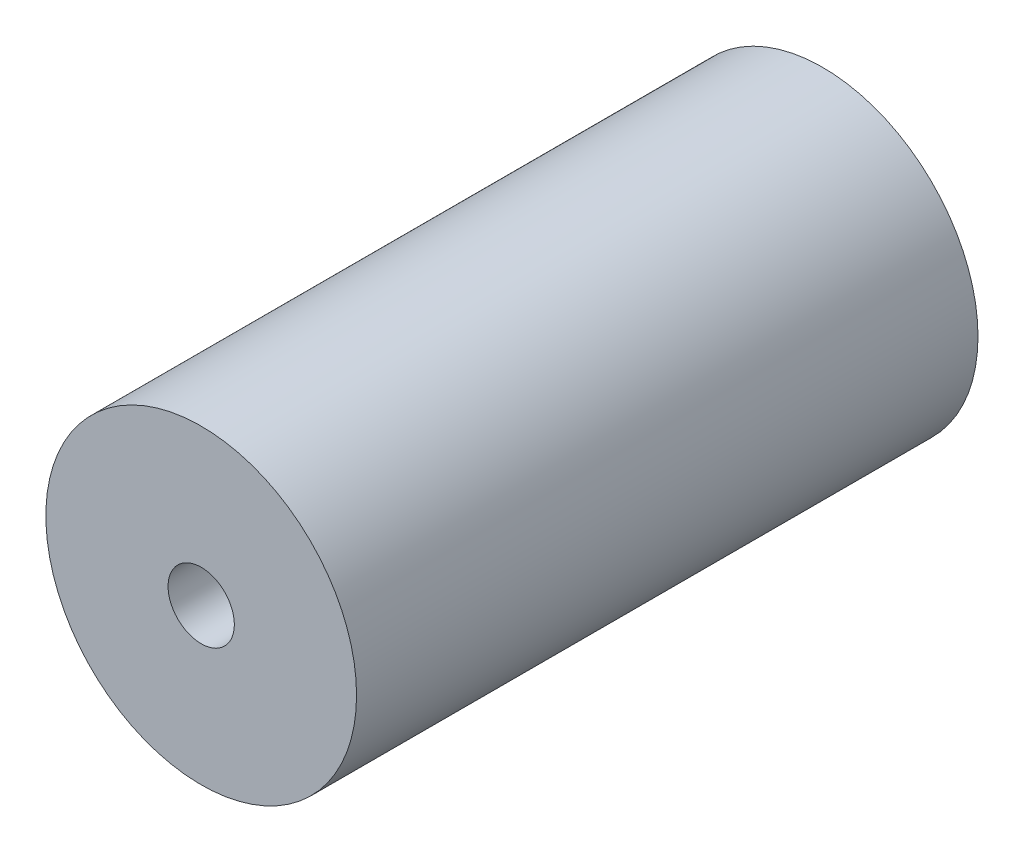
ISO-10303-21;
HEADER;
FILE_DESCRIPTION(('STEP AP214'),'2;1');
FILE_NAME('part.step','',(''),(''),'','','');
FILE_SCHEMA(('AUTOMOTIVE_DESIGN { 1 0 10303 214 1 1 1 1 }'));
ENDSEC;
DATA;
#1=APPLICATION_CONTEXT('core data for automotive mechanical design processes');
#2=APPLICATION_PROTOCOL_DEFINITION('international standard','automotive_design',2000,#1);
#3=PRODUCT_CONTEXT('',#1,'mechanical');
#4=PRODUCT('Part','Part','',(#3));
#5=PRODUCT_RELATED_PRODUCT_CATEGORY('part','',(#4));
#6=PRODUCT_DEFINITION_FORMATION('','',#4);
#7=PRODUCT_DEFINITION_CONTEXT('part definition',#1,'design');
#8=PRODUCT_DEFINITION('design','',#6,#7);
#9=PRODUCT_DEFINITION_SHAPE('','',#8);
#10=(LENGTH_UNIT() NAMED_UNIT(*) SI_UNIT(.MILLI.,.METRE.));
#11=(NAMED_UNIT(*) PLANE_ANGLE_UNIT() SI_UNIT($,.RADIAN.));
#12=(NAMED_UNIT(*) SI_UNIT($,.STERADIAN.) SOLID_ANGLE_UNIT());
#13=UNCERTAINTY_MEASURE_WITH_UNIT(LENGTH_MEASURE(1.E-05),#10,'distance_accuracy_value','');
#14=(GEOMETRIC_REPRESENTATION_CONTEXT(3) GLOBAL_UNCERTAINTY_ASSIGNED_CONTEXT((#13)) GLOBAL_UNIT_ASSIGNED_CONTEXT((#10,
#11,#12)) REPRESENTATION_CONTEXT('',''));
#15=CARTESIAN_POINT('',(0.,0.,0.));
#16=DIRECTION('',(0.,0.,1.));
#17=DIRECTION('',(1.,0.,0.));
#18=AXIS2_PLACEMENT_3D('',#15,#16,#17);
#19=CARTESIAN_POINT('',(0.,0.,30.));
#20=DIRECTION('',(0.,0.,-1.));
#21=DIRECTION('',(-1.,0.,0.));
#22=AXIS2_PLACEMENT_3D('',#19,#20,#21);
#23=CYLINDRICAL_SURFACE('',#22,7.5);
#24=CARTESIAN_POINT('',(0.,0.,30.));
#25=DIRECTION('',(0.,0.,1.));
#26=DIRECTION('',(1.,0.,0.));
#27=AXIS2_PLACEMENT_3D('',#24,#25,#26);
#28=CIRCLE('',#27,7.5);
#29=CARTESIAN_POINT('',(7.5,0.,30.));
#30=VERTEX_POINT('',#29);
#31=EDGE_CURVE('E10',#30,#30,#28,.T.);
#32=ORIENTED_EDGE('',*,*,#31,.F.);
#33=EDGE_LOOP('',(#32));
#34=FACE_BOUND('',#33,.T.);
#35=CARTESIAN_POINT('',(0.,0.,0.));
#36=DIRECTION('',(0.,0.,1.));
#37=DIRECTION('',(1.,0.,0.));
#38=AXIS2_PLACEMENT_3D('',#35,#36,#37);
#39=CIRCLE('',#38,7.5);
#40=CARTESIAN_POINT('',(7.5,0.,0.));
#41=VERTEX_POINT('',#40);
#42=EDGE_CURVE('E34',#41,#41,#39,.T.);
#43=ORIENTED_EDGE('',*,*,#42,.T.);
#44=EDGE_LOOP('',(#43));
#45=FACE_BOUND('',#44,.T.);
#46=ADVANCED_FACE('F31',(#34,#45),#23,.T.);
#47=CARTESIAN_POINT('',(0.,0.,30.));
#48=DIRECTION('',(0.,0.,1.));
#49=DIRECTION('',(1.,0.,0.));
#50=AXIS2_PLACEMENT_3D('',#47,#48,#49);
#51=PLANE('',#50);
#52=CARTESIAN_POINT('',(0.,0.,30.));
#53=DIRECTION('',(0.,0.,1.));
#54=DIRECTION('',(1.,0.,0.));
#55=AXIS2_PLACEMENT_3D('',#52,#53,#54);
#56=CIRCLE('',#55,1.6);
#57=CARTESIAN_POINT('',(1.6,0.,30.));
#58=VERTEX_POINT('',#57);
#59=EDGE_CURVE('E43',#58,#58,#56,.T.);
#60=ORIENTED_EDGE('',*,*,#59,.F.);
#61=EDGE_LOOP('',(#60));
#62=FACE_BOUND('',#61,.T.);
#63=ORIENTED_EDGE('',*,*,#31,.T.);
#64=EDGE_LOOP('',(#63));
#65=FACE_BOUND('',#64,.T.);
#66=ADVANCED_FACE('F58',(#62,#65),#51,.T.);
#67=CARTESIAN_POINT('',(0.,0.,0.));
#68=DIRECTION('',(0.,0.,1.));
#69=DIRECTION('',(1.,0.,0.));
#70=AXIS2_PLACEMENT_3D('',#67,#68,#69);
#71=PLANE('',#70);
#72=CARTESIAN_POINT('',(0.,0.,0.));
#73=DIRECTION('',(0.,0.,1.));
#74=DIRECTION('',(1.,0.,0.));
#75=AXIS2_PLACEMENT_3D('',#72,#73,#74);
#76=CIRCLE('',#75,1.6);
#77=CARTESIAN_POINT('',(1.6,0.,0.));
#78=VERTEX_POINT('',#77);
#79=EDGE_CURVE('E41',#78,#78,#76,.T.);
#80=ORIENTED_EDGE('',*,*,#79,.T.);
#81=EDGE_LOOP('',(#80));
#82=FACE_BOUND('',#81,.T.);
#83=ORIENTED_EDGE('',*,*,#42,.F.);
#84=EDGE_LOOP('',(#83));
#85=FACE_BOUND('',#84,.T.);
#86=ADVANCED_FACE('F49',(#82,#85),#71,.F.);
#87=CARTESIAN_POINT('',(0.,0.,0.));
#88=DIRECTION('',(0.,0.,1.));
#89=DIRECTION('',(1.,0.,0.));
#90=AXIS2_PLACEMENT_3D('',#87,#88,#89);
#91=CYLINDRICAL_SURFACE('',#90,1.6);
#92=ORIENTED_EDGE('',*,*,#79,.F.);
#93=EDGE_LOOP('',(#92));
#94=FACE_BOUND('',#93,.T.);
#95=ORIENTED_EDGE('',*,*,#59,.T.);
#96=EDGE_LOOP('',(#95));
#97=FACE_BOUND('',#96,.T.);
#98=ADVANCED_FACE('F52',(#94,#97),#91,.F.);
#99=CLOSED_SHELL('',(#46,#66,#86,#98));
#100=MANIFOLD_SOLID_BREP('B2',#99);
#101=ADVANCED_BREP_SHAPE_REPRESENTATION('',(#18,#100),#14);
#102=SHAPE_DEFINITION_REPRESENTATION(#9,#101);
ENDSEC;
END-ISO-10303-21;
